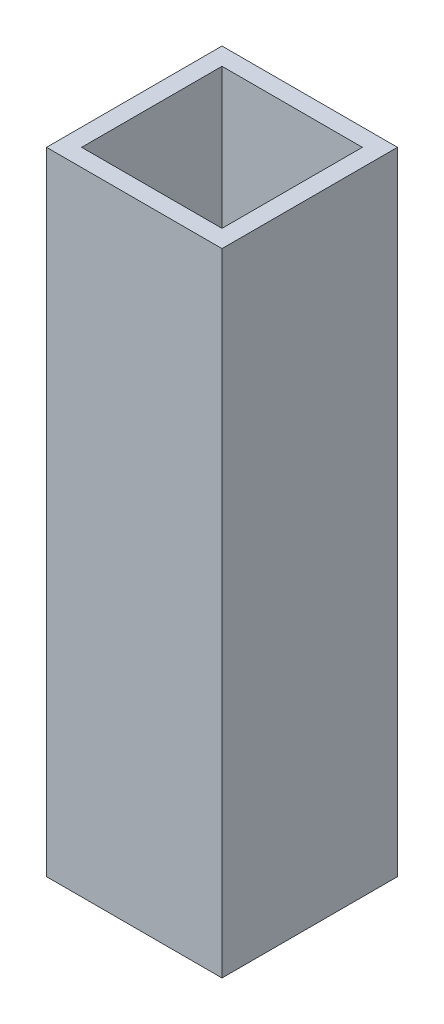
ISO-10303-21;
HEADER;
FILE_DESCRIPTION(('STEP AP214'),'2;1');
FILE_NAME('part.step','',(''),(''),'','','');
FILE_SCHEMA(('AUTOMOTIVE_DESIGN { 1 0 10303 214 1 1 1 1 }'));
ENDSEC;
DATA;
#1=APPLICATION_CONTEXT('core data for automotive mechanical design processes');
#2=APPLICATION_PROTOCOL_DEFINITION('international standard','automotive_design',2000,#1);
#3=PRODUCT_CONTEXT('',#1,'mechanical');
#4=PRODUCT('Part','Part','',(#3));
#5=PRODUCT_RELATED_PRODUCT_CATEGORY('part','',(#4));
#6=PRODUCT_DEFINITION_FORMATION('','',#4);
#7=PRODUCT_DEFINITION_CONTEXT('part definition',#1,'design');
#8=PRODUCT_DEFINITION('design','',#6,#7);
#9=PRODUCT_DEFINITION_SHAPE('','',#8);
#10=(LENGTH_UNIT() NAMED_UNIT(*) SI_UNIT(.MILLI.,.METRE.));
#11=(NAMED_UNIT(*) PLANE_ANGLE_UNIT() SI_UNIT($,.RADIAN.));
#12=(NAMED_UNIT(*) SI_UNIT($,.STERADIAN.) SOLID_ANGLE_UNIT());
#13=UNCERTAINTY_MEASURE_WITH_UNIT(LENGTH_MEASURE(1.E-05),#10,'distance_accuracy_value','');
#14=(GEOMETRIC_REPRESENTATION_CONTEXT(3) GLOBAL_UNCERTAINTY_ASSIGNED_CONTEXT((#13)) GLOBAL_UNIT_ASSIGNED_CONTEXT((#10,
#11,#12)) REPRESENTATION_CONTEXT('',''));
#15=CARTESIAN_POINT('',(0.,0.,0.));
#16=DIRECTION('',(0.,0.,1.));
#17=DIRECTION('',(1.,0.,0.));
#18=AXIS2_PLACEMENT_3D('',#15,#16,#17);
#19=CARTESIAN_POINT('',(-8.00970873786407,45.,-9.1626213592233));
#20=DIRECTION('',(1.,0.,0.));
#21=DIRECTION('',(0.,0.,-1.));
#22=AXIS2_PLACEMENT_3D('',#19,#20,#21);
#23=PLANE('',#22);
#24=DIRECTION('',(0.,0.,1.));
#25=VECTOR('',#24,1.);
#26=CARTESIAN_POINT('',(-8.00970873786407,0.,-9.1626213592233));
#27=LINE('',#26,#25);
#28=CARTESIAN_POINT('',(-8.00970873786407,0.,-9.1626213592233));
#29=VERTEX_POINT('',#28);
#30=CARTESIAN_POINT('',(-8.00970873786407,0.,3.3373786407767));
#31=VERTEX_POINT('',#30);
#32=EDGE_CURVE('E164',#29,#31,#27,.T.);
#33=ORIENTED_EDGE('',*,*,#32,.T.);
#34=DIRECTION('',(0.,-1.,0.));
#35=VECTOR('',#34,1.);
#36=CARTESIAN_POINT('',(-8.00970873786407,45.,3.3373786407767));
#37=LINE('',#36,#35);
#38=CARTESIAN_POINT('',(-8.00970873786407,45.,3.3373786407767));
#39=VERTEX_POINT('',#38);
#40=EDGE_CURVE('E11',#39,#31,#37,.T.);
#41=ORIENTED_EDGE('',*,*,#40,.F.);
#42=DIRECTION('',(0.,0.,1.));
#43=VECTOR('',#42,1.);
#44=CARTESIAN_POINT('',(-8.00970873786407,45.,-9.1626213592233));
#45=LINE('',#44,#43);
#46=CARTESIAN_POINT('',(-8.00970873786407,45.,-9.1626213592233));
#47=VERTEX_POINT('',#46);
#48=EDGE_CURVE('E170',#47,#39,#45,.T.);
#49=ORIENTED_EDGE('',*,*,#48,.F.);
#50=DIRECTION('',(0.,-1.,0.));
#51=VECTOR('',#50,1.);
#52=CARTESIAN_POINT('',(-8.00970873786407,45.,-9.1626213592233));
#53=LINE('',#52,#51);
#54=EDGE_CURVE('E180',#47,#29,#53,.T.);
#55=ORIENTED_EDGE('',*,*,#54,.T.);
#56=EDGE_LOOP('',(#33,#41,#49,#55));
#57=FACE_BOUND('',#56,.T.);
#58=ADVANCED_FACE('F45',(#57),#23,.F.);
#59=CARTESIAN_POINT('',(-8.00970873786407,45.,3.3373786407767));
#60=DIRECTION('',(0.,0.,-1.));
#61=DIRECTION('',(-1.,0.,0.));
#62=AXIS2_PLACEMENT_3D('',#59,#60,#61);
#63=PLANE('',#62);
#64=DIRECTION('',(1.,0.,0.));
#65=VECTOR('',#64,1.);
#66=CARTESIAN_POINT('',(-8.00970873786407,0.,3.3373786407767));
#67=LINE('',#66,#65);
#68=CARTESIAN_POINT('',(4.49029126213594,0.,3.3373786407767));
#69=VERTEX_POINT('',#68);
#70=EDGE_CURVE('E184',#31,#69,#67,.T.);
#71=ORIENTED_EDGE('',*,*,#70,.T.);
#72=DIRECTION('',(0.,-1.,0.));
#73=VECTOR('',#72,1.);
#74=CARTESIAN_POINT('',(4.49029126213594,45.,3.3373786407767));
#75=LINE('',#74,#73);
#76=CARTESIAN_POINT('',(4.49029126213594,45.,3.3373786407767));
#77=VERTEX_POINT('',#76);
#78=EDGE_CURVE('E53',#77,#69,#75,.T.);
#79=ORIENTED_EDGE('',*,*,#78,.F.);
#80=DIRECTION('',(1.,0.,0.));
#81=VECTOR('',#80,1.);
#82=CARTESIAN_POINT('',(-8.00970873786407,45.,3.3373786407767));
#83=LINE('',#82,#81);
#84=EDGE_CURVE('E97',#39,#77,#83,.T.);
#85=ORIENTED_EDGE('',*,*,#84,.F.);
#86=ORIENTED_EDGE('',*,*,#40,.T.);
#87=EDGE_LOOP('',(#71,#79,#85,#86));
#88=FACE_BOUND('',#87,.T.);
#89=ADVANCED_FACE('F220',(#88),#63,.F.);
#90=CARTESIAN_POINT('',(4.49029126213593,45.,-9.1626213592233));
#91=DIRECTION('',(-1.,0.,0.));
#92=DIRECTION('',(0.,0.,1.));
#93=AXIS2_PLACEMENT_3D('',#90,#91,#92);
#94=PLANE('',#93);
#95=DIRECTION('',(0.,0.,-1.));
#96=VECTOR('',#95,1.);
#97=CARTESIAN_POINT('',(4.49029126213593,0.,-9.1626213592233));
#98=LINE('',#97,#96);
#99=CARTESIAN_POINT('',(4.49029126213593,0.,-9.1626213592233));
#100=VERTEX_POINT('',#99);
#101=EDGE_CURVE('E187',#69,#100,#98,.T.);
#102=ORIENTED_EDGE('',*,*,#101,.T.);
#103=DIRECTION('',(0.,-1.,0.));
#104=VECTOR('',#103,1.);
#105=CARTESIAN_POINT('',(4.49029126213593,45.,-9.1626213592233));
#106=LINE('',#105,#104);
#107=CARTESIAN_POINT('',(4.49029126213593,45.,-9.1626213592233));
#108=VERTEX_POINT('',#107);
#109=EDGE_CURVE('E194',#108,#100,#106,.T.);
#110=ORIENTED_EDGE('',*,*,#109,.F.);
#111=DIRECTION('',(0.,0.,-1.));
#112=VECTOR('',#111,1.);
#113=CARTESIAN_POINT('',(4.49029126213593,45.,-9.1626213592233));
#114=LINE('',#113,#112);
#115=EDGE_CURVE('E175',#77,#108,#114,.T.);
#116=ORIENTED_EDGE('',*,*,#115,.F.);
#117=ORIENTED_EDGE('',*,*,#78,.T.);
#118=EDGE_LOOP('',(#102,#110,#116,#117));
#119=FACE_BOUND('',#118,.T.);
#120=ADVANCED_FACE('F201',(#119),#94,.F.);
#121=CARTESIAN_POINT('',(-8.00970873786407,45.,-9.1626213592233));
#122=DIRECTION('',(0.,0.,1.));
#123=DIRECTION('',(1.,0.,0.));
#124=AXIS2_PLACEMENT_3D('',#121,#122,#123);
#125=PLANE('',#124);
#126=DIRECTION('',(-1.,0.,0.));
#127=VECTOR('',#126,1.);
#128=CARTESIAN_POINT('',(-8.00970873786407,0.,-9.1626213592233));
#129=LINE('',#128,#127);
#130=EDGE_CURVE('E90',#100,#29,#129,.T.);
#131=ORIENTED_EDGE('',*,*,#130,.T.);
#132=ORIENTED_EDGE('',*,*,#54,.F.);
#133=DIRECTION('',(-1.,0.,0.));
#134=VECTOR('',#133,1.);
#135=CARTESIAN_POINT('',(-8.00970873786407,45.,-9.1626213592233));
#136=LINE('',#135,#134);
#137=EDGE_CURVE('E69',#108,#47,#136,.T.);
#138=ORIENTED_EDGE('',*,*,#137,.F.);
#139=ORIENTED_EDGE('',*,*,#109,.T.);
#140=EDGE_LOOP('',(#131,#132,#138,#139));
#141=FACE_BOUND('',#140,.T.);
#142=ADVANCED_FACE('F209',(#141),#125,.F.);
#143=CARTESIAN_POINT('',(0.,45.,0.));
#144=DIRECTION('',(0.,1.,0.));
#145=DIRECTION('',(0.,0.,1.));
#146=AXIS2_PLACEMENT_3D('',#143,#144,#145);
#147=PLANE('',#146);
#148=DIRECTION('',(0.,0.,1.));
#149=VECTOR('',#148,1.);
#150=CARTESIAN_POINT('',(-6.75970873786407,45.,-7.9126213592233));
#151=LINE('',#150,#149);
#152=CARTESIAN_POINT('',(-6.75970873786407,45.,-7.9126213592233));
#153=VERTEX_POINT('',#152);
#154=CARTESIAN_POINT('',(-6.75970873786406,45.,2.0873786407767));
#155=VERTEX_POINT('',#154);
#156=EDGE_CURVE('E60',#153,#155,#151,.T.);
#157=ORIENTED_EDGE('',*,*,#156,.F.);
#158=DIRECTION('',(-1.,0.,0.));
#159=VECTOR('',#158,1.);
#160=CARTESIAN_POINT('',(-6.75970873786407,45.,-7.9126213592233));
#161=LINE('',#160,#159);
#162=CARTESIAN_POINT('',(3.24029126213593,45.,-7.9126213592233));
#163=VERTEX_POINT('',#162);
#164=EDGE_CURVE('E142',#163,#153,#161,.T.);
#165=ORIENTED_EDGE('',*,*,#164,.F.);
#166=DIRECTION('',(0.,0.,-1.));
#167=VECTOR('',#166,1.);
#168=CARTESIAN_POINT('',(3.24029126213593,45.,-7.9126213592233));
#169=LINE('',#168,#167);
#170=CARTESIAN_POINT('',(3.24029126213594,45.,2.0873786407767));
#171=VERTEX_POINT('',#170);
#172=EDGE_CURVE('E146',#171,#163,#169,.T.);
#173=ORIENTED_EDGE('',*,*,#172,.F.);
#174=DIRECTION('',(1.,0.,0.));
#175=VECTOR('',#174,1.);
#176=CARTESIAN_POINT('',(-6.75970873786406,45.,2.0873786407767));
#177=LINE('',#176,#175);
#178=EDGE_CURVE('E155',#155,#171,#177,.T.);
#179=ORIENTED_EDGE('',*,*,#178,.F.);
#180=EDGE_LOOP('',(#157,#165,#173,#179));
#181=FACE_BOUND('',#180,.T.);
#182=ORIENTED_EDGE('',*,*,#48,.T.);
#183=ORIENTED_EDGE('',*,*,#84,.T.);
#184=ORIENTED_EDGE('',*,*,#115,.T.);
#185=ORIENTED_EDGE('',*,*,#137,.T.);
#186=EDGE_LOOP('',(#182,#183,#184,#185));
#187=FACE_BOUND('',#186,.T.);
#188=ADVANCED_FACE('F211',(#181,#187),#147,.T.);
#189=CARTESIAN_POINT('',(0.,0.,0.));
#190=DIRECTION('',(0.,1.,0.));
#191=DIRECTION('',(0.,0.,1.));
#192=AXIS2_PLACEMENT_3D('',#189,#190,#191);
#193=PLANE('',#192);
#194=ORIENTED_EDGE('',*,*,#32,.F.);
#195=ORIENTED_EDGE('',*,*,#130,.F.);
#196=ORIENTED_EDGE('',*,*,#101,.F.);
#197=ORIENTED_EDGE('',*,*,#70,.F.);
#198=EDGE_LOOP('',(#194,#195,#196,#197));
#199=FACE_BOUND('',#198,.T.);
#200=ADVANCED_FACE('F205',(#199),#193,.F.);
#201=CARTESIAN_POINT('',(-6.75970873786407,2.5,-7.9126213592233));
#202=DIRECTION('',(-1.,0.,0.));
#203=DIRECTION('',(0.,0.,1.));
#204=AXIS2_PLACEMENT_3D('',#201,#202,#203);
#205=PLANE('',#204);
#206=ORIENTED_EDGE('',*,*,#156,.T.);
#207=DIRECTION('',(0.,1.,0.));
#208=VECTOR('',#207,1.);
#209=CARTESIAN_POINT('',(-6.75970873786406,2.5,2.0873786407767));
#210=LINE('',#209,#208);
#211=CARTESIAN_POINT('',(-6.75970873786406,2.5,2.0873786407767));
#212=VERTEX_POINT('',#211);
#213=EDGE_CURVE('E117',#212,#155,#210,.T.);
#214=ORIENTED_EDGE('',*,*,#213,.F.);
#215=DIRECTION('',(0.,0.,1.));
#216=VECTOR('',#215,1.);
#217=CARTESIAN_POINT('',(-6.75970873786407,2.5,-7.9126213592233));
#218=LINE('',#217,#216);
#219=CARTESIAN_POINT('',(-6.75970873786407,2.5,-7.9126213592233));
#220=VERTEX_POINT('',#219);
#221=EDGE_CURVE('E121',#220,#212,#218,.T.);
#222=ORIENTED_EDGE('',*,*,#221,.F.);
#223=DIRECTION('',(0.,1.,0.));
#224=VECTOR('',#223,1.);
#225=CARTESIAN_POINT('',(-6.75970873786407,2.5,-7.9126213592233));
#226=LINE('',#225,#224);
#227=EDGE_CURVE('E161',#220,#153,#226,.T.);
#228=ORIENTED_EDGE('',*,*,#227,.T.);
#229=EDGE_LOOP('',(#206,#214,#222,#228));
#230=FACE_BOUND('',#229,.T.);
#231=ADVANCED_FACE('F119',(#230),#205,.F.);
#232=CARTESIAN_POINT('',(-6.75970873786407,2.5,-7.9126213592233));
#233=DIRECTION('',(0.,0.,-1.));
#234=DIRECTION('',(-1.,0.,0.));
#235=AXIS2_PLACEMENT_3D('',#232,#233,#234);
#236=PLANE('',#235);
#237=ORIENTED_EDGE('',*,*,#164,.T.);
#238=ORIENTED_EDGE('',*,*,#227,.F.);
#239=DIRECTION('',(-1.,0.,0.));
#240=VECTOR('',#239,1.);
#241=CARTESIAN_POINT('',(-6.75970873786407,2.5,-7.9126213592233));
#242=LINE('',#241,#240);
#243=CARTESIAN_POINT('',(3.24029126213593,2.5,-7.9126213592233));
#244=VERTEX_POINT('',#243);
#245=EDGE_CURVE('E128',#244,#220,#242,.T.);
#246=ORIENTED_EDGE('',*,*,#245,.F.);
#247=DIRECTION('',(0.,1.,0.));
#248=VECTOR('',#247,1.);
#249=CARTESIAN_POINT('',(3.24029126213593,2.5,-7.9126213592233));
#250=LINE('',#249,#248);
#251=EDGE_CURVE('E165',#244,#163,#250,.T.);
#252=ORIENTED_EDGE('',*,*,#251,.T.);
#253=EDGE_LOOP('',(#237,#238,#246,#252));
#254=FACE_BOUND('',#253,.T.);
#255=ADVANCED_FACE('F260',(#254),#236,.F.);
#256=CARTESIAN_POINT('',(3.24029126213593,2.5,-7.9126213592233));
#257=DIRECTION('',(1.,0.,0.));
#258=DIRECTION('',(0.,0.,-1.));
#259=AXIS2_PLACEMENT_3D('',#256,#257,#258);
#260=PLANE('',#259);
#261=ORIENTED_EDGE('',*,*,#172,.T.);
#262=ORIENTED_EDGE('',*,*,#251,.F.);
#263=DIRECTION('',(0.,0.,-1.));
#264=VECTOR('',#263,1.);
#265=CARTESIAN_POINT('',(3.24029126213593,2.5,-7.9126213592233));
#266=LINE('',#265,#264);
#267=CARTESIAN_POINT('',(3.24029126213594,2.5,2.0873786407767));
#268=VERTEX_POINT('',#267);
#269=EDGE_CURVE('E137',#268,#244,#266,.T.);
#270=ORIENTED_EDGE('',*,*,#269,.F.);
#271=DIRECTION('',(0.,1.,0.));
#272=VECTOR('',#271,1.);
#273=CARTESIAN_POINT('',(3.24029126213594,2.5,2.0873786407767));
#274=LINE('',#273,#272);
#275=EDGE_CURVE('E127',#268,#171,#274,.T.);
#276=ORIENTED_EDGE('',*,*,#275,.T.);
#277=EDGE_LOOP('',(#261,#262,#270,#276));
#278=FACE_BOUND('',#277,.T.);
#279=ADVANCED_FACE('F269',(#278),#260,.F.);
#280=CARTESIAN_POINT('',(-6.75970873786406,2.5,2.0873786407767));
#281=DIRECTION('',(0.,0.,1.));
#282=DIRECTION('',(1.,0.,0.));
#283=AXIS2_PLACEMENT_3D('',#280,#281,#282);
#284=PLANE('',#283);
#285=ORIENTED_EDGE('',*,*,#178,.T.);
#286=ORIENTED_EDGE('',*,*,#275,.F.);
#287=DIRECTION('',(1.,0.,0.));
#288=VECTOR('',#287,1.);
#289=CARTESIAN_POINT('',(-6.75970873786406,2.5,2.0873786407767));
#290=LINE('',#289,#288);
#291=EDGE_CURVE('E131',#212,#268,#290,.T.);
#292=ORIENTED_EDGE('',*,*,#291,.F.);
#293=ORIENTED_EDGE('',*,*,#213,.T.);
#294=EDGE_LOOP('',(#285,#286,#292,#293));
#295=FACE_BOUND('',#294,.T.);
#296=ADVANCED_FACE('F132',(#295),#284,.F.);
#297=CARTESIAN_POINT('',(0.,2.5,0.));
#298=DIRECTION('',(0.,1.,0.));
#299=DIRECTION('',(0.,0.,1.));
#300=AXIS2_PLACEMENT_3D('',#297,#298,#299);
#301=PLANE('',#300);
#302=ORIENTED_EDGE('',*,*,#221,.T.);
#303=ORIENTED_EDGE('',*,*,#291,.T.);
#304=ORIENTED_EDGE('',*,*,#269,.T.);
#305=ORIENTED_EDGE('',*,*,#245,.T.);
#306=EDGE_LOOP('',(#302,#303,#304,#305));
#307=FACE_BOUND('',#306,.T.);
#308=ADVANCED_FACE('F139',(#307),#301,.T.);
#309=CLOSED_SHELL('',(#58,#89,#120,#142,#188,#200,#231,#255,#279,#296,#308));
#310=MANIFOLD_SOLID_BREP('B2',#309);
#311=ADVANCED_BREP_SHAPE_REPRESENTATION('',(#18,#310),#14);
#312=SHAPE_DEFINITION_REPRESENTATION(#9,#311);
ENDSEC;
END-ISO-10303-21;
